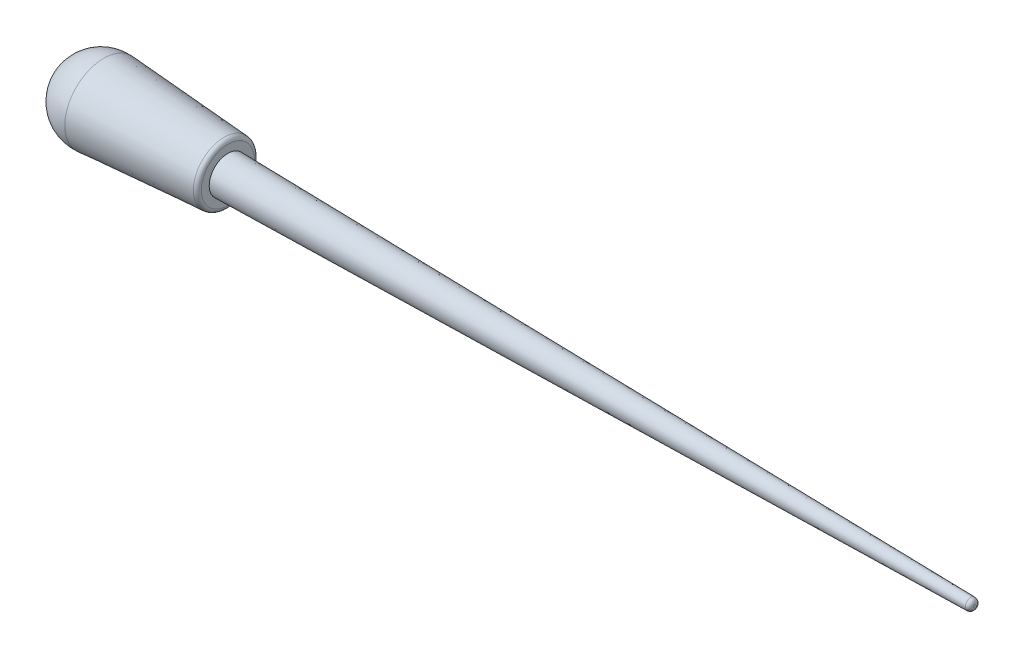
ISO-10303-21;
HEADER;
FILE_DESCRIPTION(('STEP AP214'),'2;1');
FILE_NAME('part.step','',(''),(''),'','','');
FILE_SCHEMA(('AUTOMOTIVE_DESIGN { 1 0 10303 214 1 1 1 1 }'));
ENDSEC;
DATA;
#1=APPLICATION_CONTEXT('core data for automotive mechanical design processes');
#2=APPLICATION_PROTOCOL_DEFINITION('international standard','automotive_design',2000,#1);
#3=PRODUCT_CONTEXT('',#1,'mechanical');
#4=PRODUCT('Part','Part','',(#3));
#5=PRODUCT_RELATED_PRODUCT_CATEGORY('part','',(#4));
#6=PRODUCT_DEFINITION_FORMATION('','',#4);
#7=PRODUCT_DEFINITION_CONTEXT('part definition',#1,'design');
#8=PRODUCT_DEFINITION('design','',#6,#7);
#9=PRODUCT_DEFINITION_SHAPE('','',#8);
#10=(LENGTH_UNIT() NAMED_UNIT(*) SI_UNIT(.MILLI.,.METRE.));
#11=(NAMED_UNIT(*) PLANE_ANGLE_UNIT() SI_UNIT($,.RADIAN.));
#12=(NAMED_UNIT(*) SI_UNIT($,.STERADIAN.) SOLID_ANGLE_UNIT());
#13=UNCERTAINTY_MEASURE_WITH_UNIT(LENGTH_MEASURE(1.E-05),#10,'distance_accuracy_value','');
#14=(GEOMETRIC_REPRESENTATION_CONTEXT(3) GLOBAL_UNCERTAINTY_ASSIGNED_CONTEXT((#13)) GLOBAL_UNIT_ASSIGNED_CONTEXT((#10,
#11,#12)) REPRESENTATION_CONTEXT('',''));
#15=CARTESIAN_POINT('',(0.,0.,0.));
#16=DIRECTION('',(0.,0.,1.));
#17=DIRECTION('',(1.,0.,0.));
#18=AXIS2_PLACEMENT_3D('',#15,#16,#17);
#19=CARTESIAN_POINT('',(58.7336123076546,0.,-5.81627729764605));
#20=DIRECTION('',(-1.,0.,0.));
#21=DIRECTION('',(0.,0.,1.));
#22=AXIS2_PLACEMENT_3D('',#19,#20,#21);
#23=PLANE('',#22);
#24=CARTESIAN_POINT('',(58.7336123076546,0.,0.));
#25=DIRECTION('',(-1.,0.,0.));
#26=DIRECTION('',(0.,0.,1.));
#27=AXIS2_PLACEMENT_3D('',#24,#25,#26);
#28=CIRCLE('',#27,5.07499553095982);
#29=CARTESIAN_POINT('',(58.7336123076546,0.,5.07499553095983));
#30=VERTEX_POINT('',#29);
#31=EDGE_CURVE('E46',#30,#30,#28,.F.);
#32=ORIENTED_EDGE('',*,*,#31,.T.);
#33=EDGE_LOOP('',(#32));
#34=FACE_BOUND('',#33,.T.);
#35=CARTESIAN_POINT('',(58.7336123076546,0.,0.));
#36=DIRECTION('',(-1.,0.,0.));
#37=DIRECTION('',(0.,0.,1.));
#38=AXIS2_PLACEMENT_3D('',#35,#36,#37);
#39=CIRCLE('',#38,3.571875);
#40=CARTESIAN_POINT('',(58.7336123076546,0.,3.571875));
#41=VERTEX_POINT('',#40);
#42=EDGE_CURVE('E58',#41,#41,#39,.T.);
#43=ORIENTED_EDGE('',*,*,#42,.T.);
#44=EDGE_LOOP('',(#43));
#45=FACE_BOUND('',#44,.T.);
#46=ADVANCED_FACE('F35',(#34,#45),#23,.F.);
#47=CARTESIAN_POINT('',(34.4673342448716,0.,0.));
#48=DIRECTION('',(-1.,0.,0.));
#49=DIRECTION('',(0.,0.,-1.));
#50=AXIS2_PLACEMENT_3D('',#47,#48,#49);
#51=SPHERICAL_SURFACE('',#50,7.45963647729682);
#52=CARTESIAN_POINT('',(34.9766881484215,0.,0.));
#53=DIRECTION('',(-1.,0.,0.));
#54=DIRECTION('',(0.,0.,1.));
#55=AXIS2_PLACEMENT_3D('',#52,#53,#54);
#56=CIRCLE('',#55,7.44222647964678);
#57=CARTESIAN_POINT('',(34.9766881484215,0.,7.44222647964678));
#58=VERTEX_POINT('',#57);
#59=EDGE_CURVE('E55',#58,#58,#56,.T.);
#60=ORIENTED_EDGE('',*,*,#59,.T.);
#61=EDGE_LOOP('',(#60));
#62=FACE_BOUND('',#61,.T.);
#63=ADVANCED_FACE('F77',(#62),#51,.T.);
#64=CARTESIAN_POINT('',(58.7336123076546,0.,0.));
#65=DIRECTION('',(-1.,0.,0.));
#66=DIRECTION('',(0.,0.,1.));
#67=AXIS2_PLACEMENT_3D('',#64,#65,#66);
#68=CONICAL_SURFACE('',#67,5.81627729764605,0.0683345005712122);
#69=CARTESIAN_POINT('',(57.9940606137213,0.,0.));
#70=DIRECTION('',(1.,0.,0.));
#71=DIRECTION('',(0.,0.,-1.));
#72=AXIS2_PLACEMENT_3D('',#69,#70,#71);
#73=CIRCLE('',#72,5.86689300293426);
#74=CARTESIAN_POINT('',(57.9940606137213,0.,-5.86689300293426));
#75=VERTEX_POINT('',#74);
#76=EDGE_CURVE('E50',#75,#75,#73,.F.);
#77=ORIENTED_EDGE('',*,*,#76,.T.);
#78=EDGE_LOOP('',(#77));
#79=FACE_BOUND('',#78,.T.);
#80=ORIENTED_EDGE('',*,*,#59,.F.);
#81=EDGE_LOOP('',(#80));
#82=FACE_BOUND('',#81,.T.);
#83=ADVANCED_FACE('F74',(#79,#82),#68,.T.);
#84=CARTESIAN_POINT('',(57.9398623076546,0.,0.));
#85=DIRECTION('',(-1.,0.,0.));
#86=DIRECTION('',(0.,0.,1.));
#87=AXIS2_PLACEMENT_3D('',#84,#85,#86);
#88=TOROIDAL_SURFACE('',#87,5.07499553095982,0.79375);
#89=ORIENTED_EDGE('',*,*,#31,.F.);
#90=EDGE_LOOP('',(#89));
#91=FACE_BOUND('',#90,.T.);
#92=ORIENTED_EDGE('',*,*,#76,.F.);
#93=EDGE_LOOP('',(#92));
#94=FACE_BOUND('',#93,.T.);
#95=ADVANCED_FACE('F66',(#91,#94),#88,.T.);
#96=CARTESIAN_POINT('',(58.7336123076546,0.,0.));
#97=DIRECTION('',(-1.,0.,0.));
#98=DIRECTION('',(0.,0.,1.));
#99=AXIS2_PLACEMENT_3D('',#96,#97,#98);
#100=CONICAL_SURFACE('',#99,3.571875,0.0176567499756003);
#101=CARTESIAN_POINT('',(200.828876624735,0.,0.));
#102=DIRECTION('',(1.,0.,0.));
#103=DIRECTION('',(0.,0.,-1.));
#104=AXIS2_PLACEMENT_3D('',#101,#102,#103);
#105=CIRCLE('',#104,1.06267368293026);
#106=CARTESIAN_POINT('',(200.828876624735,0.,-1.06267368293026));
#107=VERTEX_POINT('',#106);
#108=EDGE_CURVE('E10',#107,#107,#105,.F.);
#109=ORIENTED_EDGE('',*,*,#108,.T.);
#110=EDGE_LOOP('',(#109));
#111=FACE_BOUND('',#110,.T.);
#112=ORIENTED_EDGE('',*,*,#42,.F.);
#113=EDGE_LOOP('',(#112));
#114=FACE_BOUND('',#113,.T.);
#115=ADVANCED_FACE('F63',(#111,#114),#100,.T.);
#116=CARTESIAN_POINT('',(201.608612307655,0.,0.));
#117=DIRECTION('',(1.,0.,0.));
#118=DIRECTION('',(0.,0.,-1.));
#119=AXIS2_PLACEMENT_3D('',#116,#117,#118);
#120=PLANE('',#119);
#121=CARTESIAN_POINT('',(201.608612307655,0.,0.));
#122=DIRECTION('',(1.,0.,0.));
#123=DIRECTION('',(0.,0.,-1.));
#124=AXIS2_PLACEMENT_3D('',#121,#122,#123);
#125=CIRCLE('',#124,0.269047409791095);
#126=CARTESIAN_POINT('',(201.608612307655,0.,-0.269047409791094));
#127=VERTEX_POINT('',#126);
#128=EDGE_CURVE('E42',#127,#127,#125,.T.);
#129=ORIENTED_EDGE('',*,*,#128,.T.);
#130=EDGE_LOOP('',(#129));
#131=FACE_BOUND('',#130,.T.);
#132=ADVANCED_FACE('F65',(#131),#120,.T.);
#133=CARTESIAN_POINT('',(200.814862307655,0.,0.));
#134=DIRECTION('',(1.,0.,0.));
#135=DIRECTION('',(0.,0.,-1.));
#136=AXIS2_PLACEMENT_3D('',#133,#134,#135);
#137=DEGENERATE_TOROIDAL_SURFACE('',#136,0.269047409791095,0.79375,.T.);
#138=ORIENTED_EDGE('',*,*,#108,.F.);
#139=EDGE_LOOP('',(#138));
#140=FACE_BOUND('',#139,.T.);
#141=ORIENTED_EDGE('',*,*,#128,.F.);
#142=EDGE_LOOP('',(#141));
#143=FACE_BOUND('',#142,.T.);
#144=ADVANCED_FACE('F37',(#140,#143),#137,.T.);
#145=CLOSED_SHELL('',(#46,#63,#83,#95,#115,#132,#144));
#146=MANIFOLD_SOLID_BREP('B2',#145);
#147=ADVANCED_BREP_SHAPE_REPRESENTATION('',(#18,#146),#14);
#148=SHAPE_DEFINITION_REPRESENTATION(#9,#147);
ENDSEC;
END-ISO-10303-21;
